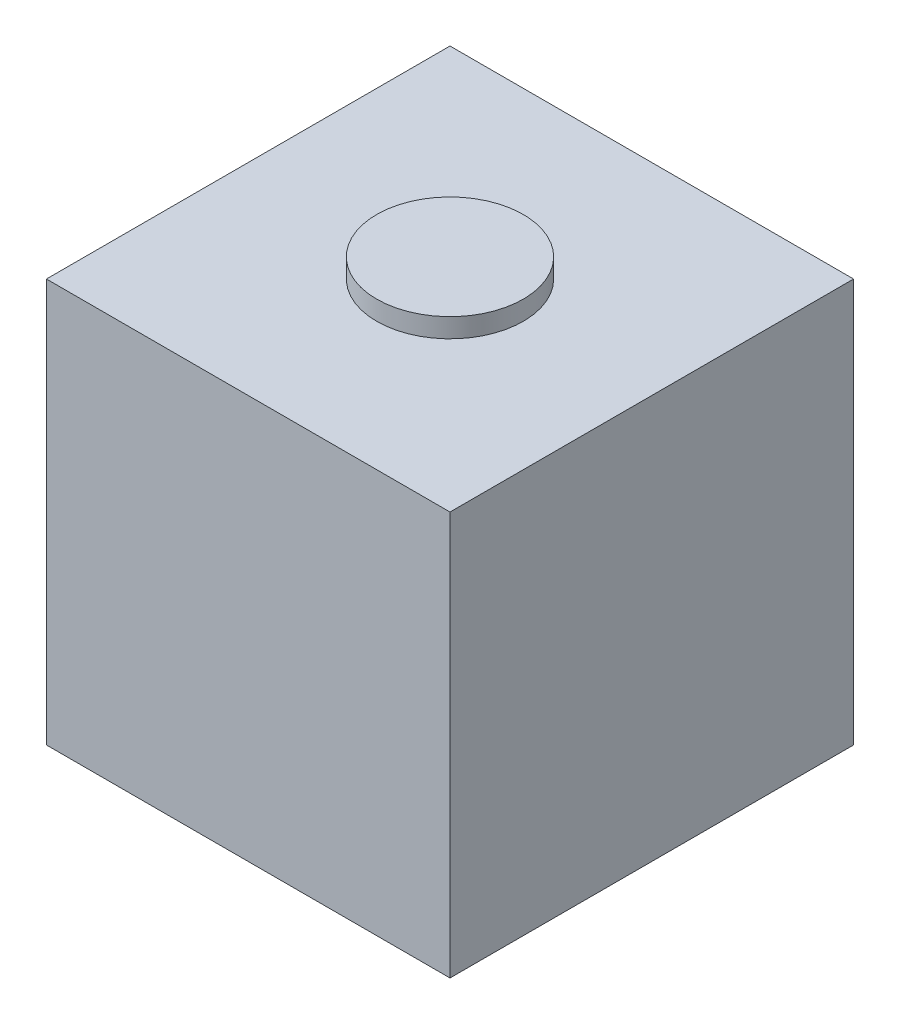
ISO-10303-21;
HEADER;
FILE_DESCRIPTION(('STEP AP214'),'2;1');
FILE_NAME('part.step','',(''),(''),'','','');
FILE_SCHEMA(('AUTOMOTIVE_DESIGN { 1 0 10303 214 1 1 1 1 }'));
ENDSEC;
DATA;
#1=APPLICATION_CONTEXT('core data for automotive mechanical design processes');
#2=APPLICATION_PROTOCOL_DEFINITION('international standard','automotive_design',2000,#1);
#3=PRODUCT_CONTEXT('',#1,'mechanical');
#4=PRODUCT('Part','Part','',(#3));
#5=PRODUCT_RELATED_PRODUCT_CATEGORY('part','',(#4));
#6=PRODUCT_DEFINITION_FORMATION('','',#4);
#7=PRODUCT_DEFINITION_CONTEXT('part definition',#1,'design');
#8=PRODUCT_DEFINITION('design','',#6,#7);
#9=PRODUCT_DEFINITION_SHAPE('','',#8);
#10=(LENGTH_UNIT() NAMED_UNIT(*) SI_UNIT(.MILLI.,.METRE.));
#11=(NAMED_UNIT(*) PLANE_ANGLE_UNIT() SI_UNIT($,.RADIAN.));
#12=(NAMED_UNIT(*) SI_UNIT($,.STERADIAN.) SOLID_ANGLE_UNIT());
#13=UNCERTAINTY_MEASURE_WITH_UNIT(LENGTH_MEASURE(1.E-05),#10,'distance_accuracy_value','');
#14=(GEOMETRIC_REPRESENTATION_CONTEXT(3) GLOBAL_UNCERTAINTY_ASSIGNED_CONTEXT((#13)) GLOBAL_UNIT_ASSIGNED_CONTEXT((#10,
#11,#12)) REPRESENTATION_CONTEXT('',''));
#15=CARTESIAN_POINT('',(0.,0.,0.));
#16=DIRECTION('',(0.,0.,1.));
#17=DIRECTION('',(1.,0.,0.));
#18=AXIS2_PLACEMENT_3D('',#15,#16,#17);
#19=CARTESIAN_POINT('',(21.,42.,21.));
#20=DIRECTION('',(-1.,0.,0.));
#21=DIRECTION('',(0.,0.,1.));
#22=AXIS2_PLACEMENT_3D('',#19,#20,#21);
#23=PLANE('',#22);
#24=DIRECTION('',(0.,0.,-1.));
#25=VECTOR('',#24,1.);
#26=CARTESIAN_POINT('',(21.,0.,21.));
#27=LINE('',#26,#25);
#28=CARTESIAN_POINT('',(21.,0.,21.));
#29=VERTEX_POINT('',#28);
#30=CARTESIAN_POINT('',(21.,0.,-21.));
#31=VERTEX_POINT('',#30);
#32=EDGE_CURVE('E101',#29,#31,#27,.T.);
#33=ORIENTED_EDGE('',*,*,#32,.T.);
#34=DIRECTION('',(0.,-1.,0.));
#35=VECTOR('',#34,1.);
#36=CARTESIAN_POINT('',(21.,42.,-21.));
#37=LINE('',#36,#35);
#38=CARTESIAN_POINT('',(21.,42.,-21.));
#39=VERTEX_POINT('',#38);
#40=EDGE_CURVE('E38',#39,#31,#37,.T.);
#41=ORIENTED_EDGE('',*,*,#40,.F.);
#42=DIRECTION('',(0.,0.,-1.));
#43=VECTOR('',#42,1.);
#44=CARTESIAN_POINT('',(21.,42.,21.));
#45=LINE('',#44,#43);
#46=CARTESIAN_POINT('',(21.,42.,21.));
#47=VERTEX_POINT('',#46);
#48=EDGE_CURVE('E88',#47,#39,#45,.T.);
#49=ORIENTED_EDGE('',*,*,#48,.F.);
#50=DIRECTION('',(0.,-1.,0.));
#51=VECTOR('',#50,1.);
#52=CARTESIAN_POINT('',(21.,42.,21.));
#53=LINE('',#52,#51);
#54=EDGE_CURVE('E97',#47,#29,#53,.T.);
#55=ORIENTED_EDGE('',*,*,#54,.T.);
#56=EDGE_LOOP('',(#33,#41,#49,#55));
#57=FACE_BOUND('',#56,.T.);
#58=ADVANCED_FACE('F35',(#57),#23,.F.);
#59=CARTESIAN_POINT('',(-21.,42.,-21.));
#60=DIRECTION('',(0.,0.,1.));
#61=DIRECTION('',(1.,0.,0.));
#62=AXIS2_PLACEMENT_3D('',#59,#60,#61);
#63=PLANE('',#62);
#64=DIRECTION('',(-1.,0.,0.));
#65=VECTOR('',#64,1.);
#66=CARTESIAN_POINT('',(-21.,0.,-21.));
#67=LINE('',#66,#65);
#68=CARTESIAN_POINT('',(-21.,0.,-21.));
#69=VERTEX_POINT('',#68);
#70=EDGE_CURVE('E93',#31,#69,#67,.T.);
#71=ORIENTED_EDGE('',*,*,#70,.T.);
#72=DIRECTION('',(0.,-1.,0.));
#73=VECTOR('',#72,1.);
#74=CARTESIAN_POINT('',(-21.,42.,-21.));
#75=LINE('',#74,#73);
#76=CARTESIAN_POINT('',(-21.,42.,-21.));
#77=VERTEX_POINT('',#76);
#78=EDGE_CURVE('E91',#77,#69,#75,.T.);
#79=ORIENTED_EDGE('',*,*,#78,.F.);
#80=DIRECTION('',(-1.,0.,0.));
#81=VECTOR('',#80,1.);
#82=CARTESIAN_POINT('',(-21.,42.,-21.));
#83=LINE('',#82,#81);
#84=EDGE_CURVE('E83',#39,#77,#83,.T.);
#85=ORIENTED_EDGE('',*,*,#84,.F.);
#86=ORIENTED_EDGE('',*,*,#40,.T.);
#87=EDGE_LOOP('',(#71,#79,#85,#86));
#88=FACE_BOUND('',#87,.T.);
#89=ADVANCED_FACE('F92',(#88),#63,.F.);
#90=CARTESIAN_POINT('',(-21.,42.,21.));
#91=DIRECTION('',(1.,0.,0.));
#92=DIRECTION('',(0.,0.,-1.));
#93=AXIS2_PLACEMENT_3D('',#90,#91,#92);
#94=PLANE('',#93);
#95=DIRECTION('',(0.,0.,1.));
#96=VECTOR('',#95,1.);
#97=CARTESIAN_POINT('',(-21.,0.,21.));
#98=LINE('',#97,#96);
#99=CARTESIAN_POINT('',(-21.,0.,21.));
#100=VERTEX_POINT('',#99);
#101=EDGE_CURVE('E69',#69,#100,#98,.T.);
#102=ORIENTED_EDGE('',*,*,#101,.T.);
#103=DIRECTION('',(0.,-1.,0.));
#104=VECTOR('',#103,1.);
#105=CARTESIAN_POINT('',(-21.,42.,21.));
#106=LINE('',#105,#104);
#107=CARTESIAN_POINT('',(-21.,42.,21.));
#108=VERTEX_POINT('',#107);
#109=EDGE_CURVE('E94',#108,#100,#106,.T.);
#110=ORIENTED_EDGE('',*,*,#109,.F.);
#111=DIRECTION('',(0.,0.,1.));
#112=VECTOR('',#111,1.);
#113=CARTESIAN_POINT('',(-21.,42.,21.));
#114=LINE('',#113,#112);
#115=EDGE_CURVE('E86',#77,#108,#114,.T.);
#116=ORIENTED_EDGE('',*,*,#115,.F.);
#117=ORIENTED_EDGE('',*,*,#78,.T.);
#118=EDGE_LOOP('',(#102,#110,#116,#117));
#119=FACE_BOUND('',#118,.T.);
#120=ADVANCED_FACE('F95',(#119),#94,.F.);
#121=CARTESIAN_POINT('',(-21.,42.,21.));
#122=DIRECTION('',(0.,0.,-1.));
#123=DIRECTION('',(-1.,0.,0.));
#124=AXIS2_PLACEMENT_3D('',#121,#122,#123);
#125=PLANE('',#124);
#126=DIRECTION('',(1.,0.,0.));
#127=VECTOR('',#126,1.);
#128=CARTESIAN_POINT('',(-21.,0.,21.));
#129=LINE('',#128,#127);
#130=EDGE_CURVE('E75',#100,#29,#129,.T.);
#131=ORIENTED_EDGE('',*,*,#130,.T.);
#132=ORIENTED_EDGE('',*,*,#54,.F.);
#133=DIRECTION('',(1.,0.,0.));
#134=VECTOR('',#133,1.);
#135=CARTESIAN_POINT('',(-21.,42.,21.));
#136=LINE('',#135,#134);
#137=EDGE_CURVE('E52',#108,#47,#136,.T.);
#138=ORIENTED_EDGE('',*,*,#137,.F.);
#139=ORIENTED_EDGE('',*,*,#109,.T.);
#140=EDGE_LOOP('',(#131,#132,#138,#139));
#141=FACE_BOUND('',#140,.T.);
#142=ADVANCED_FACE('F109',(#141),#125,.F.);
#143=CARTESIAN_POINT('',(0.,42.,0.));
#144=DIRECTION('',(0.,-1.,0.));
#145=DIRECTION('',(0.,0.,-1.));
#146=AXIS2_PLACEMENT_3D('',#143,#144,#145);
#147=PLANE('',#146);
#148=CARTESIAN_POINT('',(0.,42.,0.));
#149=DIRECTION('',(0.,1.,0.));
#150=DIRECTION('',(0.,0.,1.));
#151=AXIS2_PLACEMENT_3D('',#148,#149,#150);
#152=CIRCLE('',#151,7.63094391989696);
#153=CARTESIAN_POINT('',(0.,42.,7.63094391989696));
#154=VERTEX_POINT('',#153);
#155=EDGE_CURVE('E11',#154,#154,#152,.T.);
#156=ORIENTED_EDGE('',*,*,#155,.F.);
#157=EDGE_LOOP('',(#156));
#158=FACE_BOUND('',#157,.T.);
#159=ORIENTED_EDGE('',*,*,#48,.T.);
#160=ORIENTED_EDGE('',*,*,#84,.T.);
#161=ORIENTED_EDGE('',*,*,#115,.T.);
#162=ORIENTED_EDGE('',*,*,#137,.T.);
#163=EDGE_LOOP('',(#159,#160,#161,#162));
#164=FACE_BOUND('',#163,.T.);
#165=ADVANCED_FACE('F84',(#158,#164),#147,.F.);
#166=CARTESIAN_POINT('',(0.,0.,0.));
#167=DIRECTION('',(0.,-1.,0.));
#168=DIRECTION('',(0.,0.,-1.));
#169=AXIS2_PLACEMENT_3D('',#166,#167,#168);
#170=PLANE('',#169);
#171=ORIENTED_EDGE('',*,*,#32,.F.);
#172=ORIENTED_EDGE('',*,*,#130,.F.);
#173=ORIENTED_EDGE('',*,*,#101,.F.);
#174=ORIENTED_EDGE('',*,*,#70,.F.);
#175=EDGE_LOOP('',(#171,#172,#173,#174));
#176=FACE_BOUND('',#175,.T.);
#177=ADVANCED_FACE('F112',(#176),#170,.T.);
#178=CARTESIAN_POINT('',(0.,44.,0.));
#179=DIRECTION('',(0.,-1.,0.));
#180=DIRECTION('',(0.,0.,-1.));
#181=AXIS2_PLACEMENT_3D('',#178,#179,#180);
#182=CYLINDRICAL_SURFACE('',#181,7.63094391989696);
#183=CARTESIAN_POINT('',(0.,44.,0.));
#184=DIRECTION('',(0.,1.,0.));
#185=DIRECTION('',(0.,0.,1.));
#186=AXIS2_PLACEMENT_3D('',#183,#184,#185);
#187=CIRCLE('',#186,7.63094391989696);
#188=CARTESIAN_POINT('',(0.,44.,7.63094391989696));
#189=VERTEX_POINT('',#188);
#190=EDGE_CURVE('E104',#189,#189,#187,.T.);
#191=ORIENTED_EDGE('',*,*,#190,.F.);
#192=EDGE_LOOP('',(#191));
#193=FACE_BOUND('',#192,.T.);
#194=ORIENTED_EDGE('',*,*,#155,.T.);
#195=EDGE_LOOP('',(#194));
#196=FACE_BOUND('',#195,.T.);
#197=ADVANCED_FACE('F120',(#193,#196),#182,.T.);
#198=CARTESIAN_POINT('',(0.,44.,0.));
#199=DIRECTION('',(0.,1.,0.));
#200=DIRECTION('',(0.,0.,1.));
#201=AXIS2_PLACEMENT_3D('',#198,#199,#200);
#202=PLANE('',#201);
#203=ORIENTED_EDGE('',*,*,#190,.T.);
#204=EDGE_LOOP('',(#203));
#205=FACE_BOUND('',#204,.T.);
#206=ADVANCED_FACE('F118',(#205),#202,.T.);
#207=CLOSED_SHELL('',(#58,#89,#120,#142,#165,#177,#197,#206));
#208=MANIFOLD_SOLID_BREP('B2',#207);
#209=ADVANCED_BREP_SHAPE_REPRESENTATION('',(#18,#208),#14);
#210=SHAPE_DEFINITION_REPRESENTATION(#9,#209);
ENDSEC;
END-ISO-10303-21;
